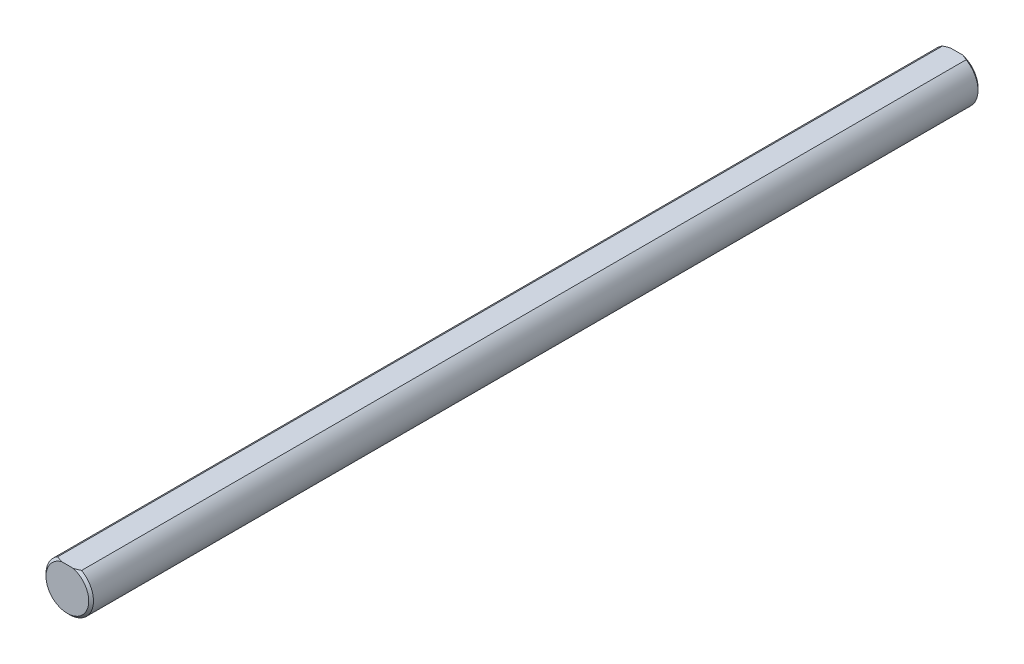
ISO-10303-21;
HEADER;
FILE_DESCRIPTION(('STEP AP214'),'2;1');
FILE_NAME('part.step','',(''),(''),'','','');
FILE_SCHEMA(('AUTOMOTIVE_DESIGN { 1 0 10303 214 1 1 1 1 }'));
ENDSEC;
DATA;
#1=APPLICATION_CONTEXT('core data for automotive mechanical design processes');
#2=APPLICATION_PROTOCOL_DEFINITION('international standard','automotive_design',2000,#1);
#3=PRODUCT_CONTEXT('',#1,'mechanical');
#4=PRODUCT('Part','Part','',(#3));
#5=PRODUCT_RELATED_PRODUCT_CATEGORY('part','',(#4));
#6=PRODUCT_DEFINITION_FORMATION('','',#4);
#7=PRODUCT_DEFINITION_CONTEXT('part definition',#1,'design');
#8=PRODUCT_DEFINITION('design','',#6,#7);
#9=PRODUCT_DEFINITION_SHAPE('','',#8);
#10=(LENGTH_UNIT() NAMED_UNIT(*) SI_UNIT(.MILLI.,.METRE.));
#11=(NAMED_UNIT(*) PLANE_ANGLE_UNIT() SI_UNIT($,.RADIAN.));
#12=(NAMED_UNIT(*) SI_UNIT($,.STERADIAN.) SOLID_ANGLE_UNIT());
#13=UNCERTAINTY_MEASURE_WITH_UNIT(LENGTH_MEASURE(1.E-05),#10,'distance_accuracy_value','');
#14=(GEOMETRIC_REPRESENTATION_CONTEXT(3) GLOBAL_UNCERTAINTY_ASSIGNED_CONTEXT((#13)) GLOBAL_UNIT_ASSIGNED_CONTEXT((#10,
#11,#12)) REPRESENTATION_CONTEXT('',''));
#15=CARTESIAN_POINT('',(0.,0.,0.));
#16=DIRECTION('',(0.,0.,1.));
#17=DIRECTION('',(1.,0.,0.));
#18=AXIS2_PLACEMENT_3D('',#15,#16,#17);
#19=CARTESIAN_POINT('',(0.,0.,59.425));
#20=DIRECTION('',(0.,0.,-1.));
#21=DIRECTION('',(-1.,0.,0.));
#22=AXIS2_PLACEMENT_3D('',#19,#20,#21);
#23=CYLINDRICAL_SURFACE('',#22,3.175);
#24=DIRECTION('',(0.,0.,1.));
#25=VECTOR('',#24,1.);
#26=CARTESIAN_POINT('',(-1.5875,2.74963065701559,-59.425));
#27=LINE('',#26,#25);
#28=CARTESIAN_POINT('',(-1.5875,2.74963065701559,-59.1075));
#29=VERTEX_POINT('',#28);
#30=CARTESIAN_POINT('',(-1.5875,2.74963065701559,59.1075));
#31=VERTEX_POINT('',#30);
#32=EDGE_CURVE('E87',#29,#31,#27,.T.);
#33=ORIENTED_EDGE('',*,*,#32,.F.);
#34=CARTESIAN_POINT('',(0.,0.,-59.1075));
#35=DIRECTION('',(0.,0.,1.));
#36=DIRECTION('',(1.,0.,0.));
#37=AXIS2_PLACEMENT_3D('',#34,#35,#36);
#38=CIRCLE('',#37,3.175);
#39=CARTESIAN_POINT('',(1.5875,2.74963065701559,-59.1075));
#40=VERTEX_POINT('',#39);
#41=EDGE_CURVE('E98',#29,#40,#38,.T.);
#42=ORIENTED_EDGE('',*,*,#41,.T.);
#43=DIRECTION('',(0.,0.,1.));
#44=VECTOR('',#43,1.);
#45=CARTESIAN_POINT('',(1.5875,2.74963065701559,-59.425));
#46=LINE('',#45,#44);
#47=CARTESIAN_POINT('',(1.5875,2.74963065701559,59.1075));
#48=VERTEX_POINT('',#47);
#49=EDGE_CURVE('E100',#40,#48,#46,.T.);
#50=ORIENTED_EDGE('',*,*,#49,.T.);
#51=CARTESIAN_POINT('',(0.,0.,59.1075));
#52=DIRECTION('',(0.,0.,1.));
#53=DIRECTION('',(1.,0.,0.));
#54=AXIS2_PLACEMENT_3D('',#51,#52,#53);
#55=CIRCLE('',#54,3.175);
#56=EDGE_CURVE('E99',#48,#31,#55,.F.);
#57=ORIENTED_EDGE('',*,*,#56,.T.);
#58=EDGE_LOOP('',(#33,#42,#50,#57));
#59=FACE_BOUND('',#58,.T.);
#60=ADVANCED_FACE('F40',(#59),#23,.T.);
#61=CARTESIAN_POINT('',(0.,0.,59.425));
#62=DIRECTION('',(0.,0.,1.));
#63=DIRECTION('',(1.,0.,0.));
#64=AXIS2_PLACEMENT_3D('',#61,#62,#63);
#65=PLANE('',#64);
#66=DIRECTION('',(1.,0.,0.));
#67=VECTOR('',#66,1.);
#68=CARTESIAN_POINT('',(-1.5875,2.74963065701559,59.425));
#69=LINE('',#68,#67);
#70=CARTESIAN_POINT('',(-0.777712993333656,2.74963065701559,59.425));
#71=VERTEX_POINT('',#70);
#72=CARTESIAN_POINT('',(0.777712993333656,2.74963065701559,59.425));
#73=VERTEX_POINT('',#72);
#74=EDGE_CURVE('E145',#71,#73,#69,.T.);
#75=ORIENTED_EDGE('',*,*,#74,.F.);
#76=CARTESIAN_POINT('',(0.,0.,59.425));
#77=DIRECTION('',(0.,0.,1.));
#78=DIRECTION('',(1.,0.,0.));
#79=AXIS2_PLACEMENT_3D('',#76,#77,#78);
#80=CIRCLE('',#79,2.8575);
#81=EDGE_CURVE('E11',#71,#73,#80,.T.);
#82=ORIENTED_EDGE('',*,*,#81,.T.);
#83=EDGE_LOOP('',(#75,#82));
#84=FACE_BOUND('',#83,.T.);
#85=ADVANCED_FACE('F138',(#84),#65,.T.);
#86=CARTESIAN_POINT('',(0.,0.,-59.425));
#87=DIRECTION('',(0.,0.,1.));
#88=DIRECTION('',(1.,0.,0.));
#89=AXIS2_PLACEMENT_3D('',#86,#87,#88);
#90=PLANE('',#89);
#91=DIRECTION('',(1.,0.,0.));
#92=VECTOR('',#91,1.);
#93=CARTESIAN_POINT('',(-1.5875,2.74963065701559,-59.425));
#94=LINE('',#93,#92);
#95=CARTESIAN_POINT('',(-0.777712993333606,2.74963065701559,-59.425));
#96=VERTEX_POINT('',#95);
#97=CARTESIAN_POINT('',(0.777712993333606,2.74963065701559,-59.425));
#98=VERTEX_POINT('',#97);
#99=EDGE_CURVE('E89',#96,#98,#94,.T.);
#100=ORIENTED_EDGE('',*,*,#99,.T.);
#101=CARTESIAN_POINT('',(0.,0.,-59.425));
#102=DIRECTION('',(0.,0.,1.));
#103=DIRECTION('',(1.,0.,0.));
#104=AXIS2_PLACEMENT_3D('',#101,#102,#103);
#105=CIRCLE('',#104,2.85749999999998);
#106=EDGE_CURVE('E49',#98,#96,#105,.F.);
#107=ORIENTED_EDGE('',*,*,#106,.T.);
#108=EDGE_LOOP('',(#100,#107));
#109=FACE_BOUND('',#108,.T.);
#110=ADVANCED_FACE('F119',(#109),#90,.F.);
#111=CARTESIAN_POINT('',(-1.5875,2.74963065701559,-59.425));
#112=DIRECTION('',(0.,-1.,0.));
#113=DIRECTION('',(0.,0.,-1.));
#114=AXIS2_PLACEMENT_3D('',#111,#112,#113);
#115=PLANE('',#114);
#116=ORIENTED_EDGE('',*,*,#49,.F.);
#117=CARTESIAN_POINT('',(1.5875,2.74963065701559,-59.1075));
#118=CARTESIAN_POINT('',(1.52250516699269,2.74963065701559,-59.1399880824799));
#119=CARTESIAN_POINT('',(1.45690188238028,2.74963065701559,-59.1713019076194));
#120=CARTESIAN_POINT('',(1.3245822707702,2.74963065701559,-59.2310258514252));
#121=CARTESIAN_POINT('',(1.25786903887731,2.74963065701559,-59.2594428470168));
#122=CARTESIAN_POINT('',(1.12308918002495,2.74963065701559,-59.3129920057044));
#123=CARTESIAN_POINT('',(1.05502199036174,2.74963065701559,-59.3381227687341));
#124=CARTESIAN_POINT('',(0.917422256787943,2.74963065701559,-59.3845821959475));
#125=CARTESIAN_POINT('',(0.847886543275474,2.74963065701559,-59.4059014355307));
#126=CARTESIAN_POINT('',(0.777712993333606,2.74963065701559,-59.425));
#127=B_SPLINE_CURVE_WITH_KNOTS('',3,(#117,#118,#119,#120,#121,#122,#123,#124,#125,#126),
.UNSPECIFIED.,.F.,.F.,(4,2,2,2,4),(0.,0.218002568777795,0.435474929897178,0.653039643130582,
0.871135095680616),.UNSPECIFIED.);
#128=EDGE_CURVE('E93',#40,#98,#127,.T.);
#129=ORIENTED_EDGE('',*,*,#128,.T.);
#130=ORIENTED_EDGE('',*,*,#99,.F.);
#131=CARTESIAN_POINT('',(-0.777712993333606,2.74963065701559,-59.425));
#132=CARTESIAN_POINT('',(-0.847886543275474,2.74963065701559,-59.4059014355307));
#133=CARTESIAN_POINT('',(-0.917422256787943,2.74963065701559,-59.3845821959475));
#134=CARTESIAN_POINT('',(-1.05502199036174,2.74963065701559,-59.3381227687341));
#135=CARTESIAN_POINT('',(-1.12308918002495,2.74963065701559,-59.3129920057044));
#136=CARTESIAN_POINT('',(-1.25786903887731,2.74963065701559,-59.2594428470168));
#137=CARTESIAN_POINT('',(-1.32458227077021,2.74963065701559,-59.2310258514252));
#138=CARTESIAN_POINT('',(-1.45690188238029,2.74963065701559,-59.1713019076194));
#139=CARTESIAN_POINT('',(-1.52250516699269,2.74963065701559,-59.1399880824799));
#140=CARTESIAN_POINT('',(-1.5875,2.74963065701559,-59.1075));
#141=B_SPLINE_CURVE_WITH_KNOTS('',3,(#131,#132,#133,#134,#135,#136,#137,#138,#139,#140),
.UNSPECIFIED.,.F.,.F.,(4,2,2,2,4),(0.,0.218095452550034,0.435660165783438,0.653132526902828,
0.871135095680615),.UNSPECIFIED.);
#142=EDGE_CURVE('E83',#96,#29,#141,.T.);
#143=ORIENTED_EDGE('',*,*,#142,.T.);
#144=ORIENTED_EDGE('',*,*,#32,.T.);
#145=CARTESIAN_POINT('',(-1.5875,2.74963065701559,59.1075));
#146=CARTESIAN_POINT('',(-1.5225051669927,2.74963065701559,59.1399880824799));
#147=CARTESIAN_POINT('',(-1.45690188238029,2.74963065701559,59.1713019076194));
#148=CARTESIAN_POINT('',(-1.32458227077022,2.74963065701559,59.2310258514252));
#149=CARTESIAN_POINT('',(-1.25786903887733,2.74963065701559,59.2594428470168));
#150=CARTESIAN_POINT('',(-1.12308918002498,2.74963065701559,59.3129920057044));
#151=CARTESIAN_POINT('',(-1.05502199036177,2.74963065701559,59.3381227687341));
#152=CARTESIAN_POINT('',(-0.917422256787986,2.74963065701559,59.3845821959475));
#153=CARTESIAN_POINT('',(-0.847886543275521,2.74963065701559,59.4059014355307));
#154=CARTESIAN_POINT('',(-0.777712993333657,2.74963065701559,59.425));
#155=B_SPLINE_CURVE_WITH_KNOTS('',3,(#145,#146,#147,#148,#149,#150,#151,#152,#153,#154),
.UNSPECIFIED.,.F.,.F.,(4,2,2,2,4),(0.,0.218002568777778,0.435474929897151,0.653039643130543,
0.871135095680564),.UNSPECIFIED.);
#156=EDGE_CURVE('E63',#31,#71,#155,.T.);
#157=ORIENTED_EDGE('',*,*,#156,.T.);
#158=ORIENTED_EDGE('',*,*,#74,.T.);
#159=CARTESIAN_POINT('',(0.777712993333656,2.74963065701559,59.425));
#160=CARTESIAN_POINT('',(0.84788654327552,2.74963065701559,59.4059014355307));
#161=CARTESIAN_POINT('',(0.917422256787985,2.74963065701559,59.3845821959475));
#162=CARTESIAN_POINT('',(1.05502199036177,2.74963065701559,59.3381227687341));
#163=CARTESIAN_POINT('',(1.12308918002498,2.74963065701559,59.3129920057044));
#164=CARTESIAN_POINT('',(1.25786903887733,2.74963065701559,59.2594428470168));
#165=CARTESIAN_POINT('',(1.32458227077022,2.74963065701559,59.2310258514252));
#166=CARTESIAN_POINT('',(1.4569018823803,2.74963065701559,59.1713019076194));
#167=CARTESIAN_POINT('',(1.5225051669927,2.74963065701559,59.1399880824799));
#168=CARTESIAN_POINT('',(1.5875,2.74963065701559,59.1075));
#169=B_SPLINE_CURVE_WITH_KNOTS('',3,(#159,#160,#161,#162,#163,#164,#165,#166,#167,#168),
.UNSPECIFIED.,.F.,.F.,(4,2,2,2,4),(0.,0.218095452550022,0.435660165783415,0.65313252690279,
0.871135095680567),.UNSPECIFIED.);
#170=EDGE_CURVE('E56',#73,#48,#169,.T.);
#171=ORIENTED_EDGE('',*,*,#170,.T.);
#172=EDGE_LOOP('',(#116,#129,#130,#143,#144,#157,#158,#171));
#173=FACE_BOUND('',#172,.T.);
#174=ADVANCED_FACE('F86',(#173),#115,.F.);
#175=CARTESIAN_POINT('',(0.,0.,-59.1075));
#176=DIRECTION('',(0.,0.,1.));
#177=DIRECTION('',(1.,0.,0.));
#178=AXIS2_PLACEMENT_3D('',#175,#176,#177);
#179=CONICAL_SURFACE('',#178,3.175,0.785398163397452);
#180=ORIENTED_EDGE('',*,*,#142,.F.);
#181=ORIENTED_EDGE('',*,*,#106,.F.);
#182=ORIENTED_EDGE('',*,*,#128,.F.);
#183=ORIENTED_EDGE('',*,*,#41,.F.);
#184=EDGE_LOOP('',(#180,#181,#182,#183));
#185=FACE_BOUND('',#184,.T.);
#186=ADVANCED_FACE('F102',(#185),#179,.T.);
#187=CARTESIAN_POINT('',(0.,0.,59.425));
#188=DIRECTION('',(0.,0.,-1.));
#189=DIRECTION('',(-1.,0.,0.));
#190=AXIS2_PLACEMENT_3D('',#187,#188,#189);
#191=CONICAL_SURFACE('',#190,2.8575,0.785398163397442);
#192=ORIENTED_EDGE('',*,*,#156,.F.);
#193=ORIENTED_EDGE('',*,*,#56,.F.);
#194=ORIENTED_EDGE('',*,*,#170,.F.);
#195=ORIENTED_EDGE('',*,*,#81,.F.);
#196=EDGE_LOOP('',(#192,#193,#194,#195));
#197=FACE_BOUND('',#196,.T.);
#198=ADVANCED_FACE('F42',(#197),#191,.T.);
#199=CLOSED_SHELL('',(#60,#85,#110,#174,#186,#198));
#200=MANIFOLD_SOLID_BREP('B2',#199);
#201=ADVANCED_BREP_SHAPE_REPRESENTATION('',(#18,#200),#14);
#202=SHAPE_DEFINITION_REPRESENTATION(#9,#201);
ENDSEC;
END-ISO-10303-21;
